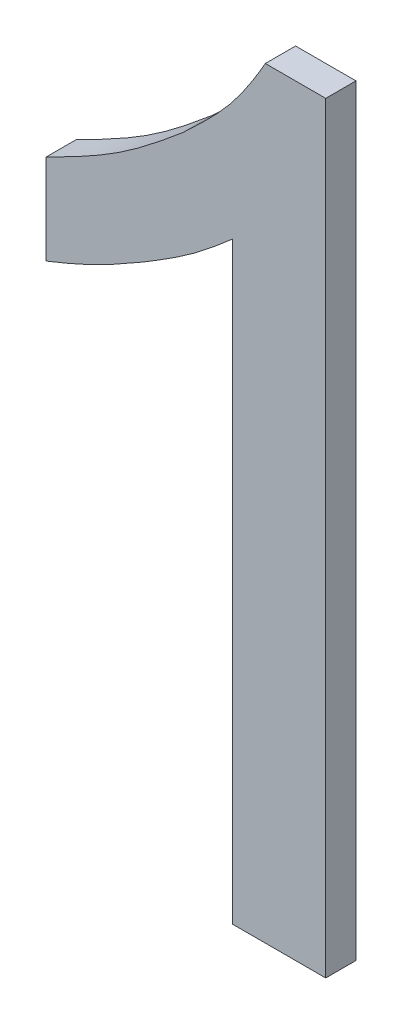
ISO-10303-21;
HEADER;
FILE_DESCRIPTION(('STEP AP214'),'2;1');
FILE_NAME('part.step','',(''),(''),'','','');
FILE_SCHEMA(('AUTOMOTIVE_DESIGN { 1 0 10303 214 1 1 1 1 }'));
ENDSEC;
DATA;
#1=APPLICATION_CONTEXT('core data for automotive mechanical design processes');
#2=APPLICATION_PROTOCOL_DEFINITION('international standard','automotive_design',2000,#1);
#3=PRODUCT_CONTEXT('',#1,'mechanical');
#4=PRODUCT('Part','Part','',(#3));
#5=PRODUCT_RELATED_PRODUCT_CATEGORY('part','',(#4));
#6=PRODUCT_DEFINITION_FORMATION('','',#4);
#7=PRODUCT_DEFINITION_CONTEXT('part definition',#1,'design');
#8=PRODUCT_DEFINITION('design','',#6,#7);
#9=PRODUCT_DEFINITION_SHAPE('','',#8);
#10=(LENGTH_UNIT() NAMED_UNIT(*) SI_UNIT(.MILLI.,.METRE.));
#11=(NAMED_UNIT(*) PLANE_ANGLE_UNIT() SI_UNIT($,.RADIAN.));
#12=(NAMED_UNIT(*) SI_UNIT($,.STERADIAN.) SOLID_ANGLE_UNIT());
#13=UNCERTAINTY_MEASURE_WITH_UNIT(LENGTH_MEASURE(1.E-05),#10,'distance_accuracy_value','');
#14=(GEOMETRIC_REPRESENTATION_CONTEXT(3) GLOBAL_UNCERTAINTY_ASSIGNED_CONTEXT((#13)) GLOBAL_UNIT_ASSIGNED_CONTEXT((#10,
#11,#12)) REPRESENTATION_CONTEXT('',''));
#15=CARTESIAN_POINT('',(0.,0.,0.));
#16=DIRECTION('',(0.,0.,1.));
#17=DIRECTION('',(1.,0.,0.));
#18=AXIS2_PLACEMENT_3D('',#15,#16,#17);
#19=CARTESIAN_POINT('',(0.257530109496,-0.00573492066018198,1.59999999404));
#20=DIRECTION('',(0.,0.,1.));
#21=DIRECTION('',(1.,0.,0.));
#22=AXIS2_PLACEMENT_3D('',#19,#20,#21);
#23=PLANE('',#22);
#24=DIRECTION('',(0.,1.,0.));
#25=VECTOR('',#24,1.);
#26=CARTESIAN_POINT('',(0.127177106589,0.06991432952927,1.59999999404));
#27=LINE('',#26,#25);
#28=CARTESIAN_POINT('',(0.127177106589,0.0401643323013601,1.59999999404));
#29=VERTEX_POINT('',#28);
#30=CARTESIAN_POINT('',(0.127177106589,0.0996643267571901,1.59999999404));
#31=VERTEX_POINT('',#30);
#32=EDGE_CURVE('E149',#29,#31,#27,.T.);
#33=ORIENTED_EDGE('',*,*,#32,.F.);
#34=CARTESIAN_POINT('',(0.191927108122,0.07201433265582,1.59999999404));
#35=CARTESIAN_POINT('',(0.189037981757389,0.0703531283240882,1.59999999404));
#36=CARTESIAN_POINT('',(0.186150230824657,0.0686890564487093,1.59999999404));
#37=CARTESIAN_POINT('',(0.180360028828748,0.0653843440244937,1.59999999404));
#38=CARTESIAN_POINT('',(0.177457572849587,0.063743712123064,1.59999999404));
#39=CARTESIAN_POINT('',(0.17162154825243,0.0605157218607356,1.59999999404));
#40=CARTESIAN_POINT('',(0.168687969139425,0.0589283822738357,1.59999999404));
#41=CARTESIAN_POINT('',(0.162773777851822,0.0558446561987143,1.59999999404));
#42=CARTESIAN_POINT('',(0.159793176037958,0.0543482500177373,1.59999999404));
#43=CARTESIAN_POINT('',(0.15194790883826,0.050576238905279,1.59999999404));
#44=CARTESIAN_POINT('',(0.147044086265544,0.0483827562362459,1.59999999404));
#45=CARTESIAN_POINT('',(0.137156294774751,0.0441674069021647,1.59999999404));
#46=CARTESIAN_POINT('',(0.132172245102012,0.0421457279290013,1.59999999404));
#47=CARTESIAN_POINT('',(0.127177106589,0.0401643323013601,1.59999999404));
#48=B_SPLINE_CURVE_WITH_KNOTS('',3,(#34,#35,#36,#37,#38,#39,#40,#41,#42,#43,#44,#45,#46,#47),
.UNSPECIFIED.,.F.,.F.,(4,2,2,2,2,2,4),(0.,0.009998401880713,0.0200004017513736,
0.0300058889569428,0.0400092015710686,0.0561204640665641,0.0722491073686261),.UNSPECIFIED.);
#49=CARTESIAN_POINT('',(0.191927108122,0.07201433265582,1.59999999404));
#50=VERTEX_POINT('',#49);
#51=EDGE_CURVE('E217',#50,#29,#48,.T.);
#52=ORIENTED_EDGE('',*,*,#51,.F.);
#53=CARTESIAN_POINT('',(0.250377092883,0.114364326466,1.59999999404));
#54=CARTESIAN_POINT('',(0.247877462528605,0.112158271338274,1.59999999404));
#55=CARTESIAN_POINT('',(0.245362228285238,0.109969073249754,1.59999999404));
#56=CARTESIAN_POINT('',(0.240285627514653,0.105645076809195,1.59999999404));
#57=CARTESIAN_POINT('',(0.237724261869121,0.103510277419342,1.59999999404));
#58=CARTESIAN_POINT('',(0.232538977207188,0.0993145435513213,1.59999999404));
#59=CARTESIAN_POINT('',(0.229915025098217,0.0972536496599814,1.59999999404));
#60=CARTESIAN_POINT('',(0.224588324278806,0.0932354952675862,1.59999999404));
#61=CARTESIAN_POINT('',(0.221885573537163,0.091278237441641,1.59999999404));
#62=CARTESIAN_POINT('',(0.214727956190148,0.0863038263891001,1.59999999404));
#63=CARTESIAN_POINT('',(0.210214451103333,0.083372261293815,1.59999999404));
#64=CARTESIAN_POINT('',(0.201105004991631,0.0776357761503081,1.59999999404));
#65=CARTESIAN_POINT('',(0.196509042816435,0.0748308892633047,1.59999999404));
#66=CARTESIAN_POINT('',(0.191927108122,0.07201433265582,1.59999999404));
#67=B_SPLINE_CURVE_WITH_KNOTS('',3,(#53,#54,#55,#56,#57,#58,#59,#60,#61,#62,#63,#64,#65,#66),
.UNSPECIFIED.,.F.,.F.,(4,2,2,2,2,2,4),(0.,0.0100024239250734,0.0200046568814001,
0.0300123011894902,0.0400202036944909,0.0561616593034526,0.0723073161405485),.UNSPECIFIED.);
#68=CARTESIAN_POINT('',(0.250377092883,0.114364326466,1.59999999404));
#69=VERTEX_POINT('',#68);
#70=EDGE_CURVE('E229',#69,#50,#67,.T.);
#71=ORIENTED_EDGE('',*,*,#70,.F.);
#72=DIRECTION('',(0.,1.,0.));
#73=VECTOR('',#72,1.);
#74=CARTESIAN_POINT('',(0.250377092883,-0.08163567162119,1.59999999404));
#75=LINE('',#74,#73);
#76=CARTESIAN_POINT('',(0.250377092883,-0.277635669708,1.59999999404));
#77=VERTEX_POINT('',#76);
#78=EDGE_CURVE('E144',#77,#69,#75,.T.);
#79=ORIENTED_EDGE('',*,*,#78,.F.);
#80=DIRECTION('',(1.,0.,0.));
#81=VECTOR('',#80,1.);
#82=CARTESIAN_POINT('',(0.281177101284,-0.277635669708,1.59999999404));
#83=LINE('',#82,#81);
#84=CARTESIAN_POINT('',(0.311977109686,-0.277635669708,1.59999999404));
#85=VERTEX_POINT('',#84);
#86=EDGE_CURVE('E139',#85,#77,#83,.F.);
#87=ORIENTED_EDGE('',*,*,#86,.F.);
#88=DIRECTION('',(0.,1.,0.));
#89=VECTOR('',#88,1.);
#90=CARTESIAN_POINT('',(0.311977109686,-0.02598566934466,1.59999999404));
#91=LINE('',#90,#89);
#92=CARTESIAN_POINT('',(0.311977109686,0.225664331019,1.59999999404));
#93=VERTEX_POINT('',#92);
#94=EDGE_CURVE('E111',#93,#85,#91,.F.);
#95=ORIENTED_EDGE('',*,*,#94,.F.);
#96=DIRECTION('',(1.,0.,0.));
#97=VECTOR('',#96,1.);
#98=CARTESIAN_POINT('',(0.292027105857,0.225664331019,1.59999999404));
#99=LINE('',#98,#97);
#100=CARTESIAN_POINT('',(0.272077102028,0.225664331019,1.59999999404));
#101=VERTEX_POINT('',#100);
#102=EDGE_CURVE('E108',#101,#93,#99,.T.);
#103=ORIENTED_EDGE('',*,*,#102,.F.);
#104=CARTESIAN_POINT('',(0.217477106489,0.158814327838,1.59999999404));
#105=CARTESIAN_POINT('',(0.22231161755112,0.163395739823721,1.59999999404));
#106=CARTESIAN_POINT('',(0.227194170282087,0.167961130491135,1.59999999404));
#107=CARTESIAN_POINT('',(0.236718864893954,0.177322702553644,1.59999999404));
#108=CARTESIAN_POINT('',(0.241361223976953,0.182118667595151,1.59999999404));
#109=CARTESIAN_POINT('',(0.248251839293686,0.190096131619496,1.59999999404));
#110=CARTESIAN_POINT('',(0.250687893478091,0.193111603042117,1.59999999404));
#111=CARTESIAN_POINT('',(0.255363932635942,0.199288724400519,1.59999999404));
#112=CARTESIAN_POINT('',(0.257603932859004,0.202450362937732,1.59999999404));
#113=CARTESIAN_POINT('',(0.261952342906826,0.208911664273875,1.59999999404));
#114=CARTESIAN_POINT('',(0.264059061643775,0.212212452298874,1.59999999404));
#115=CARTESIAN_POINT('',(0.268150530808604,0.218889446453997,1.59999999404));
#116=CARTESIAN_POINT('',(0.270135272075507,0.222265658222833,1.59999999404));
#117=CARTESIAN_POINT('',(0.272077102028,0.225664331019,1.59999999404));
#118=B_SPLINE_CURVE_WITH_KNOTS('',3,(#104,#105,#106,#107,#108,#109,#110,#111,#112,#113,#114,
#115,#116,#117),.UNSPECIFIED.,.F.,.F.,(4,2,2,2,2,2,4),(0.,0.0200244524727224,0.0400304688895578,
0.0516497693775886,0.0632681652797695,0.075012597150658,0.0867579099983253),.UNSPECIFIED.);
#119=CARTESIAN_POINT('',(0.217477106489,0.158814327838,1.59999999404));
#120=VERTEX_POINT('',#119);
#121=EDGE_CURVE('E24',#120,#101,#118,.T.);
#122=ORIENTED_EDGE('',*,*,#121,.F.);
#123=CARTESIAN_POINT('',(0.127177106589,0.0996643267571901,1.59999999404));
#124=CARTESIAN_POINT('',(0.133127891170507,0.102668896181778,1.59999999404));
#125=CARTESIAN_POINT('',(0.139081055107126,0.105681968228477,1.59999999404));
#126=CARTESIAN_POINT('',(0.150889278814775,0.111890041013255,1.59999999404));
#127=CARTESIAN_POINT('',(0.156744355651333,0.115085009669805,1.59999999404));
#128=CARTESIAN_POINT('',(0.167389643121915,0.12131582220234,1.59999999404));
#129=CARTESIAN_POINT('',(0.172207517246743,0.124303270627732,1.59999999404));
#130=CARTESIAN_POINT('',(0.18163335128139,0.130591832377899,1.59999999404));
#131=CARTESIAN_POINT('',(0.186241312009894,0.133892944479195,1.59999999404));
#132=CARTESIAN_POINT('',(0.195342300671034,0.140729873764523,1.59999999404));
#133=CARTESIAN_POINT('',(0.199833898424582,0.144267555774807,1.59999999404));
#134=CARTESIAN_POINT('',(0.208716411439046,0.151467856908379,1.59999999404));
#135=CARTESIAN_POINT('',(0.213107326890264,0.155130475795488,1.59999999404));
#136=CARTESIAN_POINT('',(0.217477106489,0.158814327838,1.59999999404));
#137=B_SPLINE_CURVE_WITH_KNOTS('',3,(#123,#124,#125,#126,#127,#128,#129,#130,#131,#132,#133,
#134,#135,#136),.UNSPECIFIED.,.F.,.F.,(4,2,2,2,2,2,4),(0.,0.020008885249224,0.0400142523523042,
0.0570093878022149,0.0740044569635197,0.0911544124654809,0.108304335549126),.UNSPECIFIED.);
#138=EDGE_CURVE('E93',#31,#120,#137,.T.);
#139=ORIENTED_EDGE('',*,*,#138,.F.);
#140=EDGE_LOOP('',(#33,#52,#71,#79,#87,#95,#103,#122,#139));
#141=FACE_BOUND('',#140,.T.);
#142=ADVANCED_FACE('F17',(#141),#23,.T.);
#143=CARTESIAN_POINT('',(0.311977109686,-0.02598566934466,1.59999999404));
#144=DIRECTION('',(1.,0.,0.));
#145=DIRECTION('',(0.,0.,-1.));
#146=AXIS2_PLACEMENT_3D('',#143,#144,#145);
#147=PLANE('',#146);
#148=DIRECTION('',(0.,1.,0.));
#149=VECTOR('',#148,1.);
#150=CARTESIAN_POINT('',(0.311977109686,-0.00573492066018198,1.57999999404));
#151=LINE('',#150,#149);
#152=CARTESIAN_POINT('',(0.311977109686,-0.277635669708,1.57999999404));
#153=VERTEX_POINT('',#152);
#154=CARTESIAN_POINT('',(0.311977109686,0.225664331019,1.57999999404));
#155=VERTEX_POINT('',#154);
#156=EDGE_CURVE('E126',#153,#155,#151,.T.);
#157=ORIENTED_EDGE('',*,*,#156,.T.);
#158=DIRECTION('',(0.,0.,1.));
#159=VECTOR('',#158,1.);
#160=CARTESIAN_POINT('',(0.311977109686,0.225664331019,1.59999999404));
#161=LINE('',#160,#159);
#162=EDGE_CURVE('E106',#93,#155,#161,.F.);
#163=ORIENTED_EDGE('',*,*,#162,.F.);
#164=ORIENTED_EDGE('',*,*,#94,.T.);
#165=DIRECTION('',(0.,0.,-1.));
#166=VECTOR('',#165,1.);
#167=CARTESIAN_POINT('',(0.311977109686,-0.277635669708,1.59999999404));
#168=LINE('',#167,#166);
#169=EDGE_CURVE('E129',#153,#85,#168,.F.);
#170=ORIENTED_EDGE('',*,*,#169,.F.);
#171=EDGE_LOOP('',(#157,#163,#164,#170));
#172=FACE_BOUND('',#171,.T.);
#173=ADVANCED_FACE('F225',(#172),#147,.T.);
#174=CARTESIAN_POINT('',(0.292027105857,0.225664331019,1.59999999404));
#175=DIRECTION('',(0.,1.,0.));
#176=DIRECTION('',(0.,0.,1.));
#177=AXIS2_PLACEMENT_3D('',#174,#175,#176);
#178=PLANE('',#177);
#179=DIRECTION('',(1.,0.,0.));
#180=VECTOR('',#179,1.);
#181=CARTESIAN_POINT('',(0.257530109496,0.225664331019,1.57999999404));
#182=LINE('',#181,#180);
#183=CARTESIAN_POINT('',(0.272077102028,0.225664331019,1.57999999404));
#184=VERTEX_POINT('',#183);
#185=EDGE_CURVE('E118',#155,#184,#182,.F.);
#186=ORIENTED_EDGE('',*,*,#185,.T.);
#187=DIRECTION('',(0.,0.,-1.));
#188=VECTOR('',#187,1.);
#189=CARTESIAN_POINT('',(0.272077102028,0.225664331019,1.58999999404));
#190=LINE('',#189,#188);
#191=EDGE_CURVE('E102',#101,#184,#190,.T.);
#192=ORIENTED_EDGE('',*,*,#191,.F.);
#193=ORIENTED_EDGE('',*,*,#102,.T.);
#194=ORIENTED_EDGE('',*,*,#162,.T.);
#195=EDGE_LOOP('',(#186,#192,#193,#194));
#196=FACE_BOUND('',#195,.T.);
#197=ADVANCED_FACE('F116',(#196),#178,.T.);
#198=CARTESIAN_POINT('',(0.217477106489,0.158814327838,1.59999999404));
#199=CARTESIAN_POINT('',(0.217477106489,0.158814327838,1.57999999404));
#200=CARTESIAN_POINT('',(0.227983612613,0.168746157297,1.59999999404));
#201=CARTESIAN_POINT('',(0.227983612613,0.168746157297,1.57999999404));
#202=CARTESIAN_POINT('',(0.249353896508,0.188533233998,1.59999999404));
#203=CARTESIAN_POINT('',(0.249353896508,0.188533233998,1.57999999404));
#204=CARTESIAN_POINT('',(0.264903416497,0.213111795688,1.59999999404));
#205=CARTESIAN_POINT('',(0.264903416497,0.213111795688,1.57999999404));
#206=CARTESIAN_POINT('',(0.272077102028,0.225664331019,1.59999999404));
#207=CARTESIAN_POINT('',(0.272077102028,0.225664331019,1.57999999404));
#208=B_SPLINE_SURFACE_WITH_KNOTS('',3,1,((#198,#199),(#200,#201),(#202,#203),(#204,#205),(#206,
#207)),.UNSPECIFIED.,.F.,.F.,.F.,(4,1,4),(2,2),(0.,0.001707613873005,0.003415227746009),(0.,1.),.UNSPECIFIED.);
#209=CARTESIAN_POINT('',(0.272077102028,0.225664331019,1.57999999404));
#210=CARTESIAN_POINT('',(0.268751467057471,0.219859466115102,1.57999999404));
#211=CARTESIAN_POINT('',(0.265301217223656,0.21409635185628,1.57999999404));
#212=CARTESIAN_POINT('',(0.257983864236216,0.202888637892038,1.57999999404));
#213=CARTESIAN_POINT('',(0.254119047477858,0.197442523226769,1.57999999404));
#214=CARTESIAN_POINT('',(0.247523511559781,0.189219791106613,1.57999999404));
#215=CARTESIAN_POINT('',(0.244996782802285,0.186281379495374,1.57999999404));
#216=CARTESIAN_POINT('',(0.239778694521204,0.180551910479145,1.57999999404));
#217=CARTESIAN_POINT('',(0.237087178492331,0.177760997997279,1.57999999404));
#218=CARTESIAN_POINT('',(0.231592716609151,0.172255414320632,1.57999999404));
#219=CARTESIAN_POINT('',(0.228789148262011,0.169541374316343,1.57999999404));
#220=CARTESIAN_POINT('',(0.223146836185267,0.16415859628512,1.57999999404));
#221=CARTESIAN_POINT('',(0.220308153253073,0.161489794947993,1.57999999404));
#222=CARTESIAN_POINT('',(0.217477106489,0.158814327838,1.57999999404));
#223=B_SPLINE_CURVE_WITH_KNOTS('',3,(#209,#210,#211,#212,#213,#214,#215,#216,#217,#218,#219,
#220,#221,#222),.UNSPECIFIED.,.F.,.F.,(4,2,2,2,2,2,4),(0.,0.0201112073671078,0.0401167058247009,
0.0517335715164519,0.0633616467238029,0.0750671270690927,0.0867545867520292),.UNSPECIFIED.);
#224=CARTESIAN_POINT('',(0.217477106489,0.158814327838,1.57999999404));
#225=VERTEX_POINT('',#224);
#226=EDGE_CURVE('E187',#184,#225,#223,.T.);
#227=DIRECTION('',(0.,0.,-1.));
#228=VECTOR('',#227,1.);
#229=CARTESIAN_POINT('',(0.217477106489,0.158814327838,1.58999999404));
#230=LINE('',#229,#228);
#231=EDGE_CURVE('E104',#120,#225,#230,.T.);
#232=ORIENTED_EDGE('',*,*,#226,.T.);
#233=ORIENTED_EDGE('',*,*,#231,.F.);
#234=ORIENTED_EDGE('',*,*,#121,.T.);
#235=ORIENTED_EDGE('',*,*,#191,.T.);
#236=EDGE_LOOP('',(#232,#233,#234,#235));
#237=FACE_BOUND('',#236,.T.);
#238=ADVANCED_FACE('F100',(#237),#208,.T.);
#239=CARTESIAN_POINT('',(0.127177106589,0.0996643267571901,1.59999999404));
#240=CARTESIAN_POINT('',(0.127177106589,0.0996643267571901,1.57999999404));
#241=CARTESIAN_POINT('',(0.143291690041,0.107791968656,1.59999999404));
#242=CARTESIAN_POINT('',(0.143291690041,0.107791968656,1.57999999404));
#243=CARTESIAN_POINT('',(0.175594074749,0.124262554234,1.59999999404));
#244=CARTESIAN_POINT('',(0.175594074749,0.124262554234,1.57999999404));
#245=CARTESIAN_POINT('',(0.203676336108,0.147183459446,1.59999999404));
#246=CARTESIAN_POINT('',(0.203676336108,0.147183459446,1.57999999404));
#247=CARTESIAN_POINT('',(0.217477106489,0.158814327838,1.59999999404));
#248=CARTESIAN_POINT('',(0.217477106489,0.158814327838,1.57999999404));
#249=B_SPLINE_SURFACE_WITH_KNOTS('',3,1,((#239,#240),(#241,#242),(#243,#244),(#245,#246),(#247,
#248)),.UNSPECIFIED.,.F.,.F.,.F.,(4,1,4),(2,2),(0.,0.00213167991201,0.004263359824021),(0.,1.),.UNSPECIFIED.);
#250=CARTESIAN_POINT('',(0.217477106489,0.158814327838,1.57999999404));
#251=CARTESIAN_POINT('',(0.212375471752576,0.154518584775533,1.57999999404));
#252=CARTESIAN_POINT('',(0.207246638411275,0.150245091902225,1.57999999404));
#253=CARTESIAN_POINT('',(0.196841860084358,0.141890815967225,1.57999999404));
#254=CARTESIAN_POINT('',(0.191566025623276,0.137809894022472,1.57999999404));
#255=CARTESIAN_POINT('',(0.181578712064928,0.13057039069982,1.57999999404));
#256=CARTESIAN_POINT('',(0.176901563982711,0.127365361602899,1.57999999404));
#257=CARTESIAN_POINT('',(0.167345093368172,0.12127148416741,1.57999999404));
#258=CARTESIAN_POINT('',(0.162465726396878,0.118382705840463,1.57999999404));
#259=CARTESIAN_POINT('',(0.152548985829232,0.112793571801158,1.57999999404));
#260=CARTESIAN_POINT('',(0.147510627279769,0.110095008871357,1.57999999404));
#261=CARTESIAN_POINT('',(0.137374616748117,0.104816007677035,1.57999999404));
#262=CARTESIAN_POINT('',(0.132276990700921,0.102235520015467,1.57999999404));
#263=CARTESIAN_POINT('',(0.127177106589,0.0996643267571901,1.57999999404));
#264=B_SPLINE_CURVE_WITH_KNOTS('',3,(#250,#251,#252,#253,#254,#255,#256,#257,#258,#259,#260,
#261,#262,#263),.UNSPECIFIED.,.F.,.F.,(4,2,2,2,2,2,4),(0.,0.0200185163081999,0.0400223673252101,
0.0570201869009501,0.0740217618782853,0.0911665948250386,0.10830418835891),.UNSPECIFIED.);
#265=CARTESIAN_POINT('',(0.127177106589,0.0996643267571901,1.57999999404));
#266=VERTEX_POINT('',#265);
#267=EDGE_CURVE('E179',#225,#266,#264,.T.);
#268=DIRECTION('',(0.,0.,1.));
#269=VECTOR('',#268,1.);
#270=CARTESIAN_POINT('',(0.127177106589,0.0996643267571901,1.59999999404));
#271=LINE('',#270,#269);
#272=EDGE_CURVE('E150',#31,#266,#271,.F.);
#273=ORIENTED_EDGE('',*,*,#267,.T.);
#274=ORIENTED_EDGE('',*,*,#272,.F.);
#275=ORIENTED_EDGE('',*,*,#138,.T.);
#276=ORIENTED_EDGE('',*,*,#231,.T.);
#277=EDGE_LOOP('',(#273,#274,#275,#276));
#278=FACE_BOUND('',#277,.T.);
#279=ADVANCED_FACE('F193',(#278),#249,.T.);
#280=CARTESIAN_POINT('',(0.127177106589,0.06991432952927,1.59999999404));
#281=DIRECTION('',(-1.,0.,0.));
#282=DIRECTION('',(0.,0.,1.));
#283=AXIS2_PLACEMENT_3D('',#280,#281,#282);
#284=PLANE('',#283);
#285=DIRECTION('',(0.,1.,0.));
#286=VECTOR('',#285,1.);
#287=CARTESIAN_POINT('',(0.127177106589,-0.005734920660182,1.57999999404));
#288=LINE('',#287,#286);
#289=CARTESIAN_POINT('',(0.127177106589,0.0401643323013601,1.57999999404));
#290=VERTEX_POINT('',#289);
#291=EDGE_CURVE('E186',#266,#290,#288,.F.);
#292=ORIENTED_EDGE('',*,*,#291,.T.);
#293=DIRECTION('',(0.,0.,-1.));
#294=VECTOR('',#293,1.);
#295=CARTESIAN_POINT('',(0.127177106589,0.0401643323013601,1.58999999404));
#296=LINE('',#295,#294);
#297=EDGE_CURVE('E235',#29,#290,#296,.T.);
#298=ORIENTED_EDGE('',*,*,#297,.F.);
#299=ORIENTED_EDGE('',*,*,#32,.T.);
#300=ORIENTED_EDGE('',*,*,#272,.T.);
#301=EDGE_LOOP('',(#292,#298,#299,#300));
#302=FACE_BOUND('',#301,.T.);
#303=ADVANCED_FACE('F198',(#302),#284,.T.);
#304=CARTESIAN_POINT('',(0.191927108122,0.07201433265582,1.59999999404));
#305=CARTESIAN_POINT('',(0.191927108122,0.07201433265582,1.57999999404));
#306=CARTESIAN_POINT('',(0.181487892648,0.06601337094978,1.59999999404));
#307=CARTESIAN_POINT('',(0.181487892648,0.06601337094978,1.57999999404));
#308=CARTESIAN_POINT('',(0.160620856807,0.0539068682516301,1.59999999404));
#309=CARTESIAN_POINT('',(0.160620856807,0.0539068682516301,1.57999999404));
#310=CARTESIAN_POINT('',(0.138372385988,0.04459766967658,1.59999999404));
#311=CARTESIAN_POINT('',(0.138372385988,0.04459766967658,1.57999999404));
#312=CARTESIAN_POINT('',(0.127177106589,0.0401643323013601,1.59999999404));
#313=CARTESIAN_POINT('',(0.127177106589,0.0401643323013601,1.57999999404));
#314=B_SPLINE_SURFACE_WITH_KNOTS('',3,1,((#304,#305),(#306,#307),(#308,#309),(#310,#311),(#312,
#313)),.UNSPECIFIED.,.F.,.F.,.F.,(4,1,4),(2,2),(0.,0.001422180460661,0.002844360921322),(0.,1.),.UNSPECIFIED.);
#315=CARTESIAN_POINT('',(0.127177106589,0.0401643323013601,1.57999999404));
#316=CARTESIAN_POINT('',(0.13027671941283,0.0413914240491517,1.57999999404));
#317=CARTESIAN_POINT('',(0.133369971428277,0.0426356414564371,1.57999999404));
#318=CARTESIAN_POINT('',(0.139534038011159,0.0451783040763202,1.57999999404));
#319=CARTESIAN_POINT('',(0.142604852567641,0.0464767493153852,1.57999999404));
#320=CARTESIAN_POINT('',(0.14871551322463,0.0491483622684362,1.57999999404));
#321=CARTESIAN_POINT('',(0.151755346818364,0.0505215588427404,1.57999999404));
#322=CARTESIAN_POINT('',(0.157788493537992,0.053367353974292,1.57999999404));
#323=CARTESIAN_POINT('',(0.160781806185506,0.0548399535528805,1.57999999404));
#324=CARTESIAN_POINT('',(0.168530568720997,0.05881132238198,1.57999999404));
#325=CARTESIAN_POINT('',(0.173245766795405,0.06138755281799,1.57999999404));
#326=CARTESIAN_POINT('',(0.18261517604411,0.0666521211188525,1.57999999404));
#327=CARTESIAN_POINT('',(0.187269374201413,0.069340482415835,1.57999999404));
#328=CARTESIAN_POINT('',(0.191927108122,0.07201433265582,1.57999999404));
#329=B_SPLINE_CURVE_WITH_KNOTS('',3,(#315,#316,#317,#318,#319,#320,#321,#322,#323,#324,#325,
#326,#327,#328),.UNSPECIFIED.,.F.,.F.,(4,2,2,2,2,2,4),(0.,0.0100015537148511,0.0200031123113074,
0.0300085601243439,0.0400141107565155,0.056130154887948,0.0722495838504834),.UNSPECIFIED.);
#330=CARTESIAN_POINT('',(0.191927108122,0.07201433265582,1.57999999404));
#331=VERTEX_POINT('',#330);
#332=EDGE_CURVE('E162',#290,#331,#329,.T.);
#333=DIRECTION('',(0.,0.,-1.));
#334=VECTOR('',#333,1.);
#335=CARTESIAN_POINT('',(0.191927108122,0.07201433265582,1.58999999404));
#336=LINE('',#335,#334);
#337=EDGE_CURVE('E146',#50,#331,#336,.T.);
#338=ORIENTED_EDGE('',*,*,#332,.T.);
#339=ORIENTED_EDGE('',*,*,#337,.F.);
#340=ORIENTED_EDGE('',*,*,#51,.T.);
#341=ORIENTED_EDGE('',*,*,#297,.T.);
#342=EDGE_LOOP('',(#338,#339,#340,#341));
#343=FACE_BOUND('',#342,.T.);
#344=ADVANCED_FACE('F202',(#343),#314,.T.);
#345=CARTESIAN_POINT('',(0.250377092883,0.114364326466,1.59999999404));
#346=CARTESIAN_POINT('',(0.250377092883,0.114364326466,1.57999999404));
#347=CARTESIAN_POINT('',(0.241341098778,0.106391399481,1.59999999404));
#348=CARTESIAN_POINT('',(0.241341098778,0.106391399481,1.57999999404));
#349=CARTESIAN_POINT('',(0.222849474185,0.0908562480464202,1.59999999404));
#350=CARTESIAN_POINT('',(0.222849474185,0.0908562480464202,1.57999999404));
#351=CARTESIAN_POINT('',(0.202197604972,0.0783177958799901,1.59999999404));
#352=CARTESIAN_POINT('',(0.202197604972,0.0783177958799901,1.57999999404));
#353=CARTESIAN_POINT('',(0.191927108122,0.07201433265582,1.59999999404));
#354=CARTESIAN_POINT('',(0.191927108122,0.07201433265582,1.57999999404));
#355=B_SPLINE_SURFACE_WITH_KNOTS('',3,1,((#345,#346),(#347,#348),(#349,#350),(#351,#352),(#353,
#354)),.UNSPECIFIED.,.F.,.F.,.F.,(4,1,4),(2,2),(0.,0.001423298202163,0.002846596404325),(0.,1.),.UNSPECIFIED.);
#356=CARTESIAN_POINT('',(0.191927108122,0.07201433265582,1.57999999404));
#357=CARTESIAN_POINT('',(0.19476743809134,0.0737571058658352,1.57999999404));
#358=CARTESIAN_POINT('',(0.197610060995049,0.0754967701258369,1.57999999404));
#359=CARTESIAN_POINT('',(0.203279634190809,0.0790045738956652,1.57999999404));
#360=CARTESIAN_POINT('',(0.206106575640401,0.0807727276334096,1.57999999404));
#361=CARTESIAN_POINT('',(0.211722912091184,0.0843713465810057,1.57999999404));
#362=CARTESIAN_POINT('',(0.214512288237059,0.0862018415664054,1.57999999404));
#363=CARTESIAN_POINT('',(0.220022450561678,0.0899624196537238,1.57999999404));
#364=CARTESIAN_POINT('',(0.222743257920677,0.091892471428034,1.57999999404));
#365=CARTESIAN_POINT('',(0.229746174538143,0.0970768441733228,1.57999999404));
#366=CARTESIAN_POINT('',(0.23396350184554,0.100418002697529,1.57999999404));
#367=CARTESIAN_POINT('',(0.242259654588174,0.10728220069976,1.57999999404));
#368=CARTESIAN_POINT('',(0.246338254709865,0.11080551463582,1.57999999404));
#369=CARTESIAN_POINT('',(0.250377092883,0.114364326466,1.57999999404));
#370=B_SPLINE_CURVE_WITH_KNOTS('',3,(#356,#357,#358,#359,#360,#361,#362,#363,#364,#365,#366,
#367,#368,#369),.UNSPECIFIED.,.F.,.F.,(4,2,2,2,2,2,4),(0.,0.00999769698835036,
0.0200005519958167,0.0300082535015604,0.0400128248622495,0.0561471803484513,0.0723065976771129),.UNSPECIFIED.);
#371=CARTESIAN_POINT('',(0.250377092883,0.114364326466,1.57999999404));
#372=VERTEX_POINT('',#371);
#373=EDGE_CURVE('E154',#331,#372,#370,.T.);
#374=DIRECTION('',(0.,0.,1.));
#375=VECTOR('',#374,1.);
#376=CARTESIAN_POINT('',(0.250377092883,0.114364326466,1.59999999404));
#377=LINE('',#376,#375);
#378=EDGE_CURVE('E141',#69,#372,#377,.F.);
#379=ORIENTED_EDGE('',*,*,#373,.T.);
#380=ORIENTED_EDGE('',*,*,#378,.F.);
#381=ORIENTED_EDGE('',*,*,#70,.T.);
#382=ORIENTED_EDGE('',*,*,#337,.T.);
#383=EDGE_LOOP('',(#379,#380,#381,#382));
#384=FACE_BOUND('',#383,.T.);
#385=ADVANCED_FACE('F19',(#384),#355,.T.);
#386=CARTESIAN_POINT('',(0.250377092883,-0.08163567162119,1.59999999404));
#387=DIRECTION('',(-1.,0.,0.));
#388=DIRECTION('',(0.,0.,1.));
#389=AXIS2_PLACEMENT_3D('',#386,#387,#388);
#390=PLANE('',#389);
#391=DIRECTION('',(0.,1.,0.));
#392=VECTOR('',#391,1.);
#393=CARTESIAN_POINT('',(0.250377092883,-0.00573492066018198,1.57999999404));
#394=LINE('',#393,#392);
#395=CARTESIAN_POINT('',(0.250377092883,-0.277635669708,1.57999999404));
#396=VERTEX_POINT('',#395);
#397=EDGE_CURVE('E36',#372,#396,#394,.F.);
#398=ORIENTED_EDGE('',*,*,#397,.T.);
#399=DIRECTION('',(0.,0.,-1.));
#400=VECTOR('',#399,1.);
#401=CARTESIAN_POINT('',(0.250377092883,-0.277635669708,1.59999999404));
#402=LINE('',#401,#400);
#403=EDGE_CURVE('E44',#77,#396,#402,.T.);
#404=ORIENTED_EDGE('',*,*,#403,.F.);
#405=ORIENTED_EDGE('',*,*,#78,.T.);
#406=ORIENTED_EDGE('',*,*,#378,.T.);
#407=EDGE_LOOP('',(#398,#404,#405,#406));
#408=FACE_BOUND('',#407,.T.);
#409=ADVANCED_FACE('F267',(#408),#390,.T.);
#410=CARTESIAN_POINT('',(0.281177101284,-0.277635669708,1.59999999404));
#411=DIRECTION('',(0.,-1.,0.));
#412=DIRECTION('',(0.,0.,-1.));
#413=AXIS2_PLACEMENT_3D('',#410,#411,#412);
#414=PLANE('',#413);
#415=DIRECTION('',(1.,0.,0.));
#416=VECTOR('',#415,1.);
#417=CARTESIAN_POINT('',(0.257530109496,-0.277635669708,1.57999999404));
#418=LINE('',#417,#416);
#419=EDGE_CURVE('E11',#396,#153,#418,.T.);
#420=ORIENTED_EDGE('',*,*,#419,.T.);
#421=ORIENTED_EDGE('',*,*,#169,.T.);
#422=ORIENTED_EDGE('',*,*,#86,.T.);
#423=ORIENTED_EDGE('',*,*,#403,.T.);
#424=EDGE_LOOP('',(#420,#421,#422,#423));
#425=FACE_BOUND('',#424,.T.);
#426=ADVANCED_FACE('F172',(#425),#414,.T.);
#427=CARTESIAN_POINT('',(0.257530109496,-0.00573492066018198,1.57999999404));
#428=DIRECTION('',(0.,0.,1.));
#429=DIRECTION('',(1.,0.,0.));
#430=AXIS2_PLACEMENT_3D('',#427,#428,#429);
#431=PLANE('',#430);
#432=ORIENTED_EDGE('',*,*,#397,.F.);
#433=ORIENTED_EDGE('',*,*,#373,.F.);
#434=ORIENTED_EDGE('',*,*,#332,.F.);
#435=ORIENTED_EDGE('',*,*,#291,.F.);
#436=ORIENTED_EDGE('',*,*,#267,.F.);
#437=ORIENTED_EDGE('',*,*,#226,.F.);
#438=ORIENTED_EDGE('',*,*,#185,.F.);
#439=ORIENTED_EDGE('',*,*,#156,.F.);
#440=ORIENTED_EDGE('',*,*,#419,.F.);
#441=EDGE_LOOP('',(#432,#433,#434,#435,#436,#437,#438,#439,#440));
#442=FACE_BOUND('',#441,.T.);
#443=ADVANCED_FACE('F168',(#442),#431,.F.);
#444=CLOSED_SHELL('',(#142,#173,#197,#238,#279,#303,#344,#385,#409,#426,#443));
#445=MANIFOLD_SOLID_BREP('B1',#444);
#446=ADVANCED_BREP_SHAPE_REPRESENTATION('',(#18,#445),#14);
#447=SHAPE_DEFINITION_REPRESENTATION(#9,#446);
ENDSEC;
END-ISO-10303-21;
